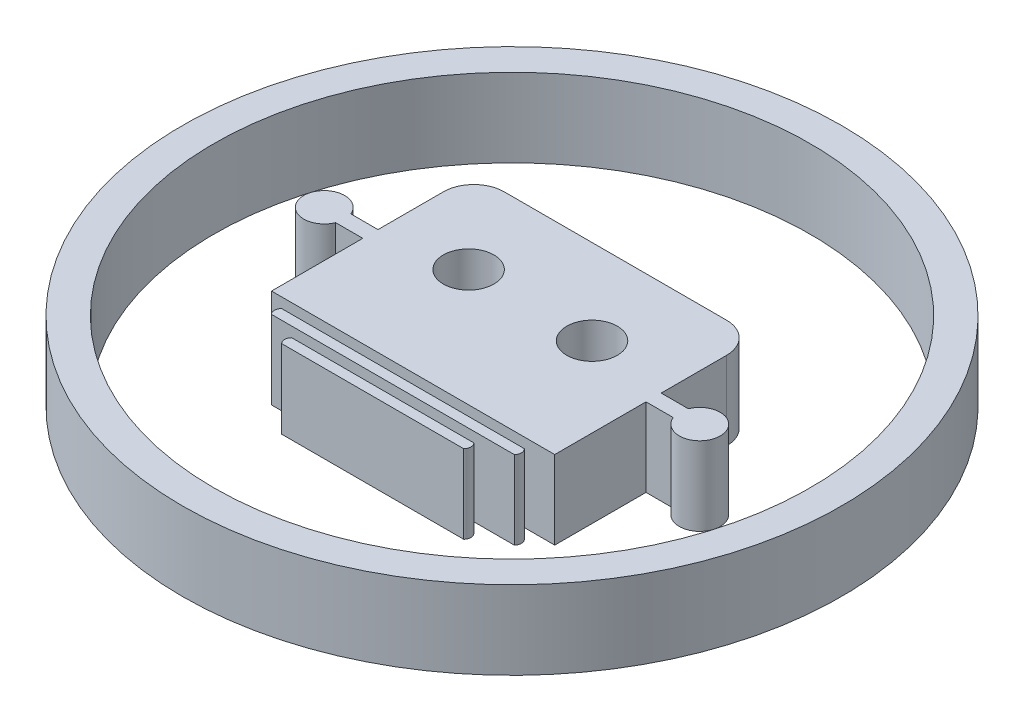
ISO-10303-21;
HEADER;
FILE_DESCRIPTION(('STEP AP214'),'2;1');
FILE_NAME('part.step','',(''),(''),'','','');
FILE_SCHEMA(('AUTOMOTIVE_DESIGN { 1 0 10303 214 1 1 1 1 }'));
ENDSEC;
DATA;
#1=APPLICATION_CONTEXT('core data for automotive mechanical design processes');
#2=APPLICATION_PROTOCOL_DEFINITION('international standard','automotive_design',2000,#1);
#3=PRODUCT_CONTEXT('',#1,'mechanical');
#4=PRODUCT('Part','Part','',(#3));
#5=PRODUCT_RELATED_PRODUCT_CATEGORY('part','',(#4));
#6=PRODUCT_DEFINITION_FORMATION('','',#4);
#7=PRODUCT_DEFINITION_CONTEXT('part definition',#1,'design');
#8=PRODUCT_DEFINITION('design','',#6,#7);
#9=PRODUCT_DEFINITION_SHAPE('','',#8);
#10=(LENGTH_UNIT() NAMED_UNIT(*) SI_UNIT(.MILLI.,.METRE.));
#11=(NAMED_UNIT(*) PLANE_ANGLE_UNIT() SI_UNIT($,.RADIAN.));
#12=(NAMED_UNIT(*) SI_UNIT($,.STERADIAN.) SOLID_ANGLE_UNIT());
#13=UNCERTAINTY_MEASURE_WITH_UNIT(LENGTH_MEASURE(1.E-05),#10,'distance_accuracy_value','');
#14=(GEOMETRIC_REPRESENTATION_CONTEXT(3) GLOBAL_UNCERTAINTY_ASSIGNED_CONTEXT((#13)) GLOBAL_UNIT_ASSIGNED_CONTEXT((#10,
#11,#12)) REPRESENTATION_CONTEXT('',''));
#15=CARTESIAN_POINT('',(0.,0.,0.));
#16=DIRECTION('',(0.,0.,1.));
#17=DIRECTION('',(1.,0.,0.));
#18=AXIS2_PLACEMENT_3D('',#15,#16,#17);
#19=CARTESIAN_POINT('',(-28.2447477639109,5.,-79.5975118594782));
#20=DIRECTION('',(0.,-1.,0.));
#21=DIRECTION('',(0.,0.,-1.));
#22=AXIS2_PLACEMENT_3D('',#19,#20,#21);
#23=CYLINDRICAL_SURFACE('',#22,0.45573183286291);
#24=CARTESIAN_POINT('',(-28.2447477639109,0.,-79.5975118594782));
#25=DIRECTION('',(0.,1.,0.));
#26=DIRECTION('',(0.,0.,1.));
#27=AXIS2_PLACEMENT_3D('',#24,#25,#26);
#28=CIRCLE('',#27,0.45573183286291);
#29=CARTESIAN_POINT('',(-27.9224966944909,0.,-79.9197629288981));
#30=VERTEX_POINT('',#29);
#31=CARTESIAN_POINT('',(-27.9224966944909,0.,-79.2752607900582));
#32=VERTEX_POINT('',#31);
#33=EDGE_CURVE('E195',#30,#32,#28,.F.);
#34=ORIENTED_EDGE('',*,*,#33,.F.);
#35=DIRECTION('',(0.,-1.,0.));
#36=VECTOR('',#35,1.);
#37=CARTESIAN_POINT('',(-27.9224966944909,5.,-79.9197629288981));
#38=LINE('',#37,#36);
#39=CARTESIAN_POINT('',(-27.9224966944909,5.,-79.9197629288981));
#40=VERTEX_POINT('',#39);
#41=EDGE_CURVE('E14',#40,#30,#38,.T.);
#42=ORIENTED_EDGE('',*,*,#41,.F.);
#43=CARTESIAN_POINT('',(-28.2447477639109,5.,-79.5975118594782));
#44=DIRECTION('',(0.,1.,0.));
#45=DIRECTION('',(0.,0.,1.));
#46=AXIS2_PLACEMENT_3D('',#43,#44,#45);
#47=CIRCLE('',#46,0.45573183286291);
#48=CARTESIAN_POINT('',(-27.9224966944909,5.,-79.2752607900582));
#49=VERTEX_POINT('',#48);
#50=EDGE_CURVE('E183',#40,#49,#47,.F.);
#51=ORIENTED_EDGE('',*,*,#50,.T.);
#52=DIRECTION('',(0.,-1.,0.));
#53=VECTOR('',#52,1.);
#54=CARTESIAN_POINT('',(-27.9224966944909,5.,-79.2752607900582));
#55=LINE('',#54,#53);
#56=EDGE_CURVE('E163',#49,#32,#55,.T.);
#57=ORIENTED_EDGE('',*,*,#56,.T.);
#58=EDGE_LOOP('',(#34,#42,#51,#57));
#59=FACE_BOUND('',#58,.T.);
#60=ADVANCED_FACE('F125',(#59),#23,.T.);
#61=CARTESIAN_POINT('',(0.,5.,-79.9197629288981));
#62=DIRECTION('',(0.,0.,-1.));
#63=DIRECTION('',(-1.,0.,0.));
#64=AXIS2_PLACEMENT_3D('',#61,#62,#63);
#65=PLANE('',#64);
#66=DIRECTION('',(1.,0.,0.));
#67=VECTOR('',#66,1.);
#68=CARTESIAN_POINT('',(0.,0.,-79.9197629288981));
#69=LINE('',#68,#67);
#70=CARTESIAN_POINT('',(-43.3905480266472,0.,-79.9197629288981));
#71=VERTEX_POINT('',#70);
#72=EDGE_CURVE('E176',#71,#30,#69,.T.);
#73=ORIENTED_EDGE('',*,*,#72,.F.);
#74=DIRECTION('',(0.,-1.,0.));
#75=VECTOR('',#74,1.);
#76=CARTESIAN_POINT('',(-43.3905480266472,5.,-79.9197629288981));
#77=LINE('',#76,#75);
#78=CARTESIAN_POINT('',(-43.3905480266472,5.,-79.9197629288981));
#79=VERTEX_POINT('',#78);
#80=EDGE_CURVE('E133',#79,#71,#77,.T.);
#81=ORIENTED_EDGE('',*,*,#80,.F.);
#82=DIRECTION('',(1.,0.,0.));
#83=VECTOR('',#82,1.);
#84=CARTESIAN_POINT('',(0.,5.,-79.9197629288981));
#85=LINE('',#84,#83);
#86=EDGE_CURVE('E174',#79,#40,#85,.T.);
#87=ORIENTED_EDGE('',*,*,#86,.T.);
#88=ORIENTED_EDGE('',*,*,#41,.T.);
#89=EDGE_LOOP('',(#73,#81,#87,#88));
#90=FACE_BOUND('',#89,.T.);
#91=ADVANCED_FACE('F172',(#90),#65,.T.);
#92=CARTESIAN_POINT('',(-43.0682969572273,5.,-79.5975118594782));
#93=DIRECTION('',(0.,-1.,0.));
#94=DIRECTION('',(0.,0.,-1.));
#95=AXIS2_PLACEMENT_3D('',#92,#93,#94);
#96=CYLINDRICAL_SURFACE('',#95,0.455731832862915);
#97=CARTESIAN_POINT('',(-43.0682969572273,0.,-79.5975118594782));
#98=DIRECTION('',(0.,1.,0.));
#99=DIRECTION('',(0.,0.,1.));
#100=AXIS2_PLACEMENT_3D('',#97,#98,#99);
#101=CIRCLE('',#100,0.455731832862915);
#102=CARTESIAN_POINT('',(-43.3905480266472,0.,-79.2752607900582));
#103=VERTEX_POINT('',#102);
#104=EDGE_CURVE('E156',#71,#103,#101,.T.);
#105=ORIENTED_EDGE('',*,*,#104,.T.);
#106=DIRECTION('',(0.,-1.,0.));
#107=VECTOR('',#106,1.);
#108=CARTESIAN_POINT('',(-43.3905480266472,5.,-79.2752607900582));
#109=LINE('',#108,#107);
#110=CARTESIAN_POINT('',(-43.3905480266472,5.,-79.2752607900582));
#111=VERTEX_POINT('',#110);
#112=EDGE_CURVE('E177',#111,#103,#109,.T.);
#113=ORIENTED_EDGE('',*,*,#112,.F.);
#114=CARTESIAN_POINT('',(-43.0682969572273,5.,-79.5975118594782));
#115=DIRECTION('',(0.,1.,0.));
#116=DIRECTION('',(0.,0.,1.));
#117=AXIS2_PLACEMENT_3D('',#114,#115,#116);
#118=CIRCLE('',#117,0.455731832862915);
#119=EDGE_CURVE('E178',#79,#111,#118,.T.);
#120=ORIENTED_EDGE('',*,*,#119,.F.);
#121=ORIENTED_EDGE('',*,*,#80,.T.);
#122=EDGE_LOOP('',(#105,#113,#120,#121));
#123=FACE_BOUND('',#122,.T.);
#124=ADVANCED_FACE('F179',(#123),#96,.T.);
#125=CARTESIAN_POINT('',(0.,5.,-79.2752607900582));
#126=DIRECTION('',(0.,0.,-1.));
#127=DIRECTION('',(-1.,0.,0.));
#128=AXIS2_PLACEMENT_3D('',#125,#126,#127);
#129=PLANE('',#128);
#130=DIRECTION('',(1.,0.,0.));
#131=VECTOR('',#130,1.);
#132=CARTESIAN_POINT('',(0.,0.,-79.2752607900582));
#133=LINE('',#132,#131);
#134=EDGE_CURVE('E187',#103,#32,#133,.T.);
#135=ORIENTED_EDGE('',*,*,#134,.T.);
#136=ORIENTED_EDGE('',*,*,#56,.F.);
#137=DIRECTION('',(1.,0.,0.));
#138=VECTOR('',#137,1.);
#139=CARTESIAN_POINT('',(0.,5.,-79.2752607900582));
#140=LINE('',#139,#138);
#141=EDGE_CURVE('E141',#111,#49,#140,.T.);
#142=ORIENTED_EDGE('',*,*,#141,.F.);
#143=ORIENTED_EDGE('',*,*,#112,.T.);
#144=EDGE_LOOP('',(#135,#136,#142,#143));
#145=FACE_BOUND('',#144,.T.);
#146=ADVANCED_FACE('F204',(#145),#129,.F.);
#147=CARTESIAN_POINT('',(0.,5.,0.));
#148=DIRECTION('',(0.,1.,0.));
#149=DIRECTION('',(0.,0.,1.));
#150=AXIS2_PLACEMENT_3D('',#147,#148,#149);
#151=PLANE('',#150);
#152=ORIENTED_EDGE('',*,*,#50,.F.);
#153=ORIENTED_EDGE('',*,*,#86,.F.);
#154=ORIENTED_EDGE('',*,*,#119,.T.);
#155=ORIENTED_EDGE('',*,*,#141,.T.);
#156=EDGE_LOOP('',(#152,#153,#154,#155));
#157=FACE_BOUND('',#156,.T.);
#158=ADVANCED_FACE('F182',(#157),#151,.T.);
#159=CARTESIAN_POINT('',(0.,0.,0.));
#160=DIRECTION('',(0.,1.,0.));
#161=DIRECTION('',(0.,0.,1.));
#162=AXIS2_PLACEMENT_3D('',#159,#160,#161);
#163=PLANE('',#162);
#164=ORIENTED_EDGE('',*,*,#33,.T.);
#165=ORIENTED_EDGE('',*,*,#134,.F.);
#166=ORIENTED_EDGE('',*,*,#104,.F.);
#167=ORIENTED_EDGE('',*,*,#72,.T.);
#168=EDGE_LOOP('',(#164,#165,#166,#167));
#169=FACE_BOUND('',#168,.T.);
#170=ADVANCED_FACE('F206',(#169),#163,.F.);
#171=CLOSED_SHELL('',(#60,#91,#124,#146,#158,#170));
#172=MANIFOLD_SOLID_BREP('B2',#171);
#173=CARTESIAN_POINT('',(-30.1782541804304,5.,-78.3085075817985));
#174=DIRECTION('',(0.,-1.,0.));
#175=DIRECTION('',(0.,0.,-1.));
#176=AXIS2_PLACEMENT_3D('',#173,#174,#175);
#177=CYLINDRICAL_SURFACE('',#176,0.45573183286289);
#178=CARTESIAN_POINT('',(-30.1782541804304,0.,-78.3085075817985));
#179=DIRECTION('',(0.,1.,0.));
#180=DIRECTION('',(0.,0.,1.));
#181=AXIS2_PLACEMENT_3D('',#178,#179,#180);
#182=CIRCLE('',#181,0.45573183286289);
#183=CARTESIAN_POINT('',(-29.8560031110105,0.,-78.6307586512184));
#184=VERTEX_POINT('',#183);
#185=CARTESIAN_POINT('',(-29.8560031110105,0.,-77.9862565123785));
#186=VERTEX_POINT('',#185);
#187=EDGE_CURVE('E339',#184,#186,#182,.F.);
#188=ORIENTED_EDGE('',*,*,#187,.F.);
#189=DIRECTION('',(0.,-1.,0.));
#190=VECTOR('',#189,1.);
#191=CARTESIAN_POINT('',(-29.8560031110105,5.,-78.6307586512184));
#192=LINE('',#191,#190);
#193=CARTESIAN_POINT('',(-29.8560031110105,5.,-78.6307586512184));
#194=VERTEX_POINT('',#193);
#195=EDGE_CURVE('E123',#194,#184,#192,.T.);
#196=ORIENTED_EDGE('',*,*,#195,.F.);
#197=CARTESIAN_POINT('',(-30.1782541804304,5.,-78.3085075817985));
#198=DIRECTION('',(0.,1.,0.));
#199=DIRECTION('',(0.,0.,1.));
#200=AXIS2_PLACEMENT_3D('',#197,#198,#199);
#201=CIRCLE('',#200,0.45573183286289);
#202=CARTESIAN_POINT('',(-29.8560031110105,5.,-77.9862565123785));
#203=VERTEX_POINT('',#202);
#204=EDGE_CURVE('E327',#194,#203,#201,.F.);
#205=ORIENTED_EDGE('',*,*,#204,.T.);
#206=DIRECTION('',(0.,-1.,0.));
#207=VECTOR('',#206,1.);
#208=CARTESIAN_POINT('',(-29.8560031110105,5.,-77.9862565123785));
#209=LINE('',#208,#207);
#210=EDGE_CURVE('E307',#203,#186,#209,.T.);
#211=ORIENTED_EDGE('',*,*,#210,.T.);
#212=EDGE_LOOP('',(#188,#196,#205,#211));
#213=FACE_BOUND('',#212,.T.);
#214=ADVANCED_FACE('F269',(#213),#177,.T.);
#215=CARTESIAN_POINT('',(0.,5.,-78.6307586512184));
#216=DIRECTION('',(0.,0.,-1.));
#217=DIRECTION('',(-1.,0.,0.));
#218=AXIS2_PLACEMENT_3D('',#215,#216,#217);
#219=PLANE('',#218);
#220=DIRECTION('',(1.,0.,0.));
#221=VECTOR('',#220,1.);
#222=CARTESIAN_POINT('',(0.,0.,-78.6307586512184));
#223=LINE('',#222,#221);
#224=CARTESIAN_POINT('',(-41.4570416101277,0.,-78.6307586512184));
#225=VERTEX_POINT('',#224);
#226=EDGE_CURVE('E320',#225,#184,#223,.T.);
#227=ORIENTED_EDGE('',*,*,#226,.F.);
#228=DIRECTION('',(0.,-1.,0.));
#229=VECTOR('',#228,1.);
#230=CARTESIAN_POINT('',(-41.4570416101277,5.,-78.6307586512184));
#231=LINE('',#230,#229);
#232=CARTESIAN_POINT('',(-41.4570416101277,5.,-78.6307586512184));
#233=VERTEX_POINT('',#232);
#234=EDGE_CURVE('E277',#233,#225,#231,.T.);
#235=ORIENTED_EDGE('',*,*,#234,.F.);
#236=DIRECTION('',(1.,0.,0.));
#237=VECTOR('',#236,1.);
#238=CARTESIAN_POINT('',(0.,5.,-78.6307586512184));
#239=LINE('',#238,#237);
#240=EDGE_CURVE('E318',#233,#194,#239,.T.);
#241=ORIENTED_EDGE('',*,*,#240,.T.);
#242=ORIENTED_EDGE('',*,*,#195,.T.);
#243=EDGE_LOOP('',(#227,#235,#241,#242));
#244=FACE_BOUND('',#243,.T.);
#245=ADVANCED_FACE('F316',(#244),#219,.T.);
#246=CARTESIAN_POINT('',(-41.1347905407077,5.,-78.3085075817985));
#247=DIRECTION('',(0.,-1.,0.));
#248=DIRECTION('',(0.,0.,-1.));
#249=AXIS2_PLACEMENT_3D('',#246,#247,#248);
#250=CYLINDRICAL_SURFACE('',#249,0.45573183286289);
#251=CARTESIAN_POINT('',(-41.1347905407077,0.,-78.3085075817985));
#252=DIRECTION('',(0.,1.,0.));
#253=DIRECTION('',(0.,0.,1.));
#254=AXIS2_PLACEMENT_3D('',#251,#252,#253);
#255=CIRCLE('',#254,0.45573183286289);
#256=CARTESIAN_POINT('',(-41.4570416101277,0.,-77.9862565123785));
#257=VERTEX_POINT('',#256);
#258=EDGE_CURVE('E300',#225,#257,#255,.T.);
#259=ORIENTED_EDGE('',*,*,#258,.T.);
#260=DIRECTION('',(0.,-1.,0.));
#261=VECTOR('',#260,1.);
#262=CARTESIAN_POINT('',(-41.4570416101277,5.,-77.9862565123785));
#263=LINE('',#262,#261);
#264=CARTESIAN_POINT('',(-41.4570416101277,5.,-77.9862565123785));
#265=VERTEX_POINT('',#264);
#266=EDGE_CURVE('E321',#265,#257,#263,.T.);
#267=ORIENTED_EDGE('',*,*,#266,.F.);
#268=CARTESIAN_POINT('',(-41.1347905407077,5.,-78.3085075817985));
#269=DIRECTION('',(0.,1.,0.));
#270=DIRECTION('',(0.,0.,1.));
#271=AXIS2_PLACEMENT_3D('',#268,#269,#270);
#272=CIRCLE('',#271,0.45573183286289);
#273=EDGE_CURVE('E322',#233,#265,#272,.T.);
#274=ORIENTED_EDGE('',*,*,#273,.F.);
#275=ORIENTED_EDGE('',*,*,#234,.T.);
#276=EDGE_LOOP('',(#259,#267,#274,#275));
#277=FACE_BOUND('',#276,.T.);
#278=ADVANCED_FACE('F323',(#277),#250,.T.);
#279=CARTESIAN_POINT('',(0.,5.,-77.9862565123785));
#280=DIRECTION('',(0.,0.,-1.));
#281=DIRECTION('',(-1.,0.,0.));
#282=AXIS2_PLACEMENT_3D('',#279,#280,#281);
#283=PLANE('',#282);
#284=DIRECTION('',(1.,0.,0.));
#285=VECTOR('',#284,1.);
#286=CARTESIAN_POINT('',(0.,0.,-77.9862565123785));
#287=LINE('',#286,#285);
#288=EDGE_CURVE('E331',#257,#186,#287,.T.);
#289=ORIENTED_EDGE('',*,*,#288,.T.);
#290=ORIENTED_EDGE('',*,*,#210,.F.);
#291=DIRECTION('',(1.,0.,0.));
#292=VECTOR('',#291,1.);
#293=CARTESIAN_POINT('',(0.,5.,-77.9862565123785));
#294=LINE('',#293,#292);
#295=EDGE_CURVE('E285',#265,#203,#294,.T.);
#296=ORIENTED_EDGE('',*,*,#295,.F.);
#297=ORIENTED_EDGE('',*,*,#266,.T.);
#298=EDGE_LOOP('',(#289,#290,#296,#297));
#299=FACE_BOUND('',#298,.T.);
#300=ADVANCED_FACE('F348',(#299),#283,.F.);
#301=CARTESIAN_POINT('',(0.,5.,0.));
#302=DIRECTION('',(0.,1.,0.));
#303=DIRECTION('',(0.,0.,1.));
#304=AXIS2_PLACEMENT_3D('',#301,#302,#303);
#305=PLANE('',#304);
#306=ORIENTED_EDGE('',*,*,#204,.F.);
#307=ORIENTED_EDGE('',*,*,#240,.F.);
#308=ORIENTED_EDGE('',*,*,#273,.T.);
#309=ORIENTED_EDGE('',*,*,#295,.T.);
#310=EDGE_LOOP('',(#306,#307,#308,#309));
#311=FACE_BOUND('',#310,.T.);
#312=ADVANCED_FACE('F326',(#311),#305,.T.);
#313=CARTESIAN_POINT('',(0.,0.,0.));
#314=DIRECTION('',(0.,1.,0.));
#315=DIRECTION('',(0.,0.,1.));
#316=AXIS2_PLACEMENT_3D('',#313,#314,#315);
#317=PLANE('',#316);
#318=ORIENTED_EDGE('',*,*,#187,.T.);
#319=ORIENTED_EDGE('',*,*,#288,.F.);
#320=ORIENTED_EDGE('',*,*,#258,.F.);
#321=ORIENTED_EDGE('',*,*,#226,.T.);
#322=EDGE_LOOP('',(#318,#319,#320,#321));
#323=FACE_BOUND('',#322,.T.);
#324=ADVANCED_FACE('F350',(#323),#317,.F.);
#325=CLOSED_SHELL('',(#214,#245,#278,#300,#312,#324));
#326=MANIFOLD_SOLID_BREP('B8',#325);
#327=CARTESIAN_POINT('',(-26.6334924168118,5.,-1.77157378714725E-13));
#328=DIRECTION('',(1.,0.,0.));
#329=DIRECTION('',(0.,0.,-1.));
#330=AXIS2_PLACEMENT_3D('',#327,#328,#329);
#331=PLANE('',#330);
#332=DIRECTION('',(0.,0.,1.));
#333=VECTOR('',#332,1.);
#334=CARTESIAN_POINT('',(-26.6334924168118,0.,-1.77157378714725E-13));
#335=LINE('',#334,#333);
#336=CARTESIAN_POINT('',(-26.6334924168112,0.,-91.5208014280153));
#337=VERTEX_POINT('',#336);
#338=CARTESIAN_POINT('',(-26.6334924168112,0.,-87.3480826959693));
#339=VERTEX_POINT('',#338);
#340=EDGE_CURVE('E653',#337,#339,#335,.T.);
#341=ORIENTED_EDGE('',*,*,#340,.F.);
#342=DIRECTION('',(0.,-1.,0.));
#343=VECTOR('',#342,1.);
#344=CARTESIAN_POINT('',(-26.6334924168112,5.,-91.5208014280153));
#345=LINE('',#344,#343);
#346=CARTESIAN_POINT('',(-26.6334924168112,5.,-91.5208014280153));
#347=VERTEX_POINT('',#346);
#348=EDGE_CURVE('E267',#347,#337,#345,.T.);
#349=ORIENTED_EDGE('',*,*,#348,.F.);
#350=DIRECTION('',(0.,0.,1.));
#351=VECTOR('',#350,1.);
#352=CARTESIAN_POINT('',(-26.6334924168118,5.,-1.77157378714725E-13));
#353=LINE('',#352,#351);
#354=CARTESIAN_POINT('',(-26.6334924168112,5.,-87.3480826959693));
#355=VERTEX_POINT('',#354);
#356=EDGE_CURVE('E598',#347,#355,#353,.T.);
#357=ORIENTED_EDGE('',*,*,#356,.T.);
#358=DIRECTION('',(0.,-1.,0.));
#359=VECTOR('',#358,1.);
#360=CARTESIAN_POINT('',(-26.6334924168112,5.,-87.3480826959693));
#361=LINE('',#360,#359);
#362=EDGE_CURVE('E427',#355,#339,#361,.T.);
#363=ORIENTED_EDGE('',*,*,#362,.T.);
#364=EDGE_LOOP('',(#341,#349,#357,#363));
#365=FACE_BOUND('',#364,.T.);
#366=ADVANCED_FACE('F410',(#365),#331,.T.);
#367=CARTESIAN_POINT('',(-28.5669988333308,5.,-91.5208014280153));
#368=DIRECTION('',(0.,-1.,0.));
#369=DIRECTION('',(0.,0.,-1.));
#370=AXIS2_PLACEMENT_3D('',#367,#368,#369);
#371=CYLINDRICAL_SURFACE('',#370,1.93350641651954);
#372=CARTESIAN_POINT('',(-28.5669988333308,0.,-91.5208014280153));
#373=DIRECTION('',(0.,1.,0.));
#374=DIRECTION('',(0.,0.,1.));
#375=AXIS2_PLACEMENT_3D('',#372,#373,#374);
#376=CIRCLE('',#375,1.93350641651954);
#377=CARTESIAN_POINT('',(-28.5669988333308,0.,-93.4543078445348));
#378=VERTEX_POINT('',#377);
#379=EDGE_CURVE('E651',#337,#378,#376,.T.);
#380=ORIENTED_EDGE('',*,*,#379,.T.);
#381=DIRECTION('',(0.,-1.,0.));
#382=VECTOR('',#381,1.);
#383=CARTESIAN_POINT('',(-28.5669988333308,5.,-93.4543078445348));
#384=LINE('',#383,#382);
#385=CARTESIAN_POINT('',(-28.5669988333308,5.,-93.4543078445348));
#386=VERTEX_POINT('',#385);
#387=EDGE_CURVE('E419',#386,#378,#384,.T.);
#388=ORIENTED_EDGE('',*,*,#387,.F.);
#389=CARTESIAN_POINT('',(-28.5669988333308,5.,-91.5208014280153));
#390=DIRECTION('',(0.,1.,0.));
#391=DIRECTION('',(0.,0.,1.));
#392=AXIS2_PLACEMENT_3D('',#389,#390,#391);
#393=CIRCLE('',#392,1.93350641651954);
#394=EDGE_CURVE('E595',#347,#386,#393,.T.);
#395=ORIENTED_EDGE('',*,*,#394,.F.);
#396=ORIENTED_EDGE('',*,*,#348,.T.);
#397=EDGE_LOOP('',(#380,#388,#395,#396));
#398=FACE_BOUND('',#397,.T.);
#399=ADVANCED_FACE('F652',(#398),#371,.T.);
#400=CARTESIAN_POINT('',(0.,5.,-93.4543078445348));
#401=DIRECTION('',(0.,0.,-1.));
#402=DIRECTION('',(-1.,0.,0.));
#403=AXIS2_PLACEMENT_3D('',#400,#401,#402);
#404=PLANE('',#403);
#405=DIRECTION('',(1.,0.,0.));
#406=VECTOR('',#405,1.);
#407=CARTESIAN_POINT('',(0.,0.,-93.4543078445348));
#408=LINE('',#407,#406);
#409=CARTESIAN_POINT('',(-42.7460458878074,0.,-93.4543078445348));
#410=VERTEX_POINT('',#409);
#411=EDGE_CURVE('E647',#410,#378,#408,.T.);
#412=ORIENTED_EDGE('',*,*,#411,.F.);
#413=DIRECTION('',(0.,-1.,0.));
#414=VECTOR('',#413,1.);
#415=CARTESIAN_POINT('',(-42.7460458878074,5.,-93.4543078445348));
#416=LINE('',#415,#414);
#417=CARTESIAN_POINT('',(-42.7460458878074,5.,-93.4543078445348));
#418=VERTEX_POINT('',#417);
#419=EDGE_CURVE('E639',#418,#410,#416,.T.);
#420=ORIENTED_EDGE('',*,*,#419,.F.);
#421=DIRECTION('',(1.,0.,0.));
#422=VECTOR('',#421,1.);
#423=CARTESIAN_POINT('',(0.,5.,-93.4543078445348));
#424=LINE('',#423,#422);
#425=EDGE_CURVE('E587',#418,#386,#424,.T.);
#426=ORIENTED_EDGE('',*,*,#425,.T.);
#427=ORIENTED_EDGE('',*,*,#387,.T.);
#428=EDGE_LOOP('',(#412,#420,#426,#427));
#429=FACE_BOUND('',#428,.T.);
#430=ADVANCED_FACE('F645',(#429),#404,.T.);
#431=CARTESIAN_POINT('',(-42.7460458878074,5.,-91.5208014280153));
#432=DIRECTION('',(0.,-1.,0.));
#433=DIRECTION('',(0.,0.,-1.));
#434=AXIS2_PLACEMENT_3D('',#431,#432,#433);
#435=CYLINDRICAL_SURFACE('',#434,1.93350641651953);
#436=CARTESIAN_POINT('',(-42.7460458878074,0.,-91.5208014280153));
#437=DIRECTION('',(0.,1.,0.));
#438=DIRECTION('',(0.,0.,1.));
#439=AXIS2_PLACEMENT_3D('',#436,#437,#438);
#440=CIRCLE('',#439,1.93350641651953);
#441=CARTESIAN_POINT('',(-44.6795523043269,0.,-91.5208014280153));
#442=VERTEX_POINT('',#441);
#443=EDGE_CURVE('E659',#410,#442,#440,.T.);
#444=ORIENTED_EDGE('',*,*,#443,.T.);
#445=DIRECTION('',(0.,-1.,0.));
#446=VECTOR('',#445,1.);
#447=CARTESIAN_POINT('',(-44.6795523043269,5.,-91.5208014280153));
#448=LINE('',#447,#446);
#449=CARTESIAN_POINT('',(-44.6795523043269,5.,-91.5208014280153));
#450=VERTEX_POINT('',#449);
#451=EDGE_CURVE('E637',#450,#442,#448,.T.);
#452=ORIENTED_EDGE('',*,*,#451,.F.);
#453=CARTESIAN_POINT('',(-42.7460458878074,5.,-91.5208014280153));
#454=DIRECTION('',(0.,1.,0.));
#455=DIRECTION('',(0.,0.,1.));
#456=AXIS2_PLACEMENT_3D('',#453,#454,#455);
#457=CIRCLE('',#456,1.93350641651953);
#458=EDGE_CURVE('E583',#418,#450,#457,.T.);
#459=ORIENTED_EDGE('',*,*,#458,.F.);
#460=ORIENTED_EDGE('',*,*,#419,.T.);
#461=EDGE_LOOP('',(#444,#452,#459,#460));
#462=FACE_BOUND('',#461,.T.);
#463=ADVANCED_FACE('F713',(#462),#435,.T.);
#464=CARTESIAN_POINT('',(-44.6795523043275,5.,-2.97193933281755E-13));
#465=DIRECTION('',(-1.,0.,0.));
#466=DIRECTION('',(0.,0.,1.));
#467=AXIS2_PLACEMENT_3D('',#464,#465,#466);
#468=PLANE('',#467);
#469=DIRECTION('',(0.,0.,-1.));
#470=VECTOR('',#469,1.);
#471=CARTESIAN_POINT('',(-44.6795523043275,0.,-2.97193933281755E-13));
#472=LINE('',#471,#470);
#473=CARTESIAN_POINT('',(-44.6795523043269,0.,-87.3480826959693));
#474=VERTEX_POINT('',#473);
#475=EDGE_CURVE('E661',#474,#442,#472,.T.);
#476=ORIENTED_EDGE('',*,*,#475,.F.);
#477=DIRECTION('',(0.,-1.,0.));
#478=VECTOR('',#477,1.);
#479=CARTESIAN_POINT('',(-44.6795523043269,5.,-87.3480826959693));
#480=LINE('',#479,#478);
#481=CARTESIAN_POINT('',(-44.6795523043269,5.,-87.3480826959693));
#482=VERTEX_POINT('',#481);
#483=EDGE_CURVE('E635',#482,#474,#480,.T.);
#484=ORIENTED_EDGE('',*,*,#483,.F.);
#485=DIRECTION('',(0.,0.,-1.));
#486=VECTOR('',#485,1.);
#487=CARTESIAN_POINT('',(-44.6795523043275,5.,-2.97193933281755E-13));
#488=LINE('',#487,#486);
#489=EDGE_CURVE('E578',#482,#450,#488,.T.);
#490=ORIENTED_EDGE('',*,*,#489,.T.);
#491=ORIENTED_EDGE('',*,*,#451,.T.);
#492=EDGE_LOOP('',(#476,#484,#490,#491));
#493=FACE_BOUND('',#492,.T.);
#494=ADVANCED_FACE('F708',(#493),#468,.T.);
#495=CARTESIAN_POINT('',(0.,5.,-87.3480826959693));
#496=DIRECTION('',(0.,0.,-1.));
#497=DIRECTION('',(-1.,0.,0.));
#498=AXIS2_PLACEMENT_3D('',#495,#496,#497);
#499=PLANE('',#498);
#500=DIRECTION('',(1.,0.,0.));
#501=VECTOR('',#500,1.);
#502=CARTESIAN_POINT('',(0.,0.,-87.3480826959693));
#503=LINE('',#502,#501);
#504=CARTESIAN_POINT('',(-46.4121857606302,0.,-87.3480826959693));
#505=VERTEX_POINT('',#504);
#506=EDGE_CURVE('E666',#505,#474,#503,.T.);
#507=ORIENTED_EDGE('',*,*,#506,.F.);
#508=DIRECTION('',(0.,-1.,0.));
#509=VECTOR('',#508,1.);
#510=CARTESIAN_POINT('',(-46.4121857606302,5.,-87.3480826959693));
#511=LINE('',#510,#509);
#512=CARTESIAN_POINT('',(-46.4121857606302,5.,-87.3480826959693));
#513=VERTEX_POINT('',#512);
#514=EDGE_CURVE('E633',#513,#505,#511,.T.);
#515=ORIENTED_EDGE('',*,*,#514,.F.);
#516=DIRECTION('',(1.,0.,0.));
#517=VECTOR('',#516,1.);
#518=CARTESIAN_POINT('',(0.,5.,-87.3480826959693));
#519=LINE('',#518,#517);
#520=EDGE_CURVE('E574',#513,#482,#519,.T.);
#521=ORIENTED_EDGE('',*,*,#520,.T.);
#522=ORIENTED_EDGE('',*,*,#483,.T.);
#523=EDGE_LOOP('',(#507,#515,#521,#522));
#524=FACE_BOUND('',#523,.T.);
#525=ADVANCED_FACE('F705',(#524),#499,.T.);
#526=CARTESIAN_POINT('',(-47.6224304451511,5.,-86.8647060918394));
#527=DIRECTION('',(0.,-1.,0.));
#528=DIRECTION('',(0.,0.,-1.));
#529=AXIS2_PLACEMENT_3D('',#526,#527,#528);
#530=CYLINDRICAL_SURFACE('',#529,1.30320571585279);
#531=CARTESIAN_POINT('',(-47.6224304451511,0.,-86.8647060918394));
#532=DIRECTION('',(0.,1.,0.));
#533=DIRECTION('',(0.,0.,1.));
#534=AXIS2_PLACEMENT_3D('',#531,#532,#533);
#535=CIRCLE('',#534,1.30320571585279);
#536=CARTESIAN_POINT('',(-46.4121857606302,0.,-86.3813294877095));
#537=VERTEX_POINT('',#536);
#538=EDGE_CURVE('E669',#505,#537,#535,.T.);
#539=ORIENTED_EDGE('',*,*,#538,.T.);
#540=DIRECTION('',(0.,-1.,0.));
#541=VECTOR('',#540,1.);
#542=CARTESIAN_POINT('',(-46.4121857606302,5.,-86.3813294877095));
#543=LINE('',#542,#541);
#544=CARTESIAN_POINT('',(-46.4121857606302,5.,-86.3813294877095));
#545=VERTEX_POINT('',#544);
#546=EDGE_CURVE('E631',#545,#537,#543,.T.);
#547=ORIENTED_EDGE('',*,*,#546,.F.);
#548=CARTESIAN_POINT('',(-47.6224304451511,5.,-86.8647060918394));
#549=DIRECTION('',(0.,1.,0.));
#550=DIRECTION('',(0.,0.,1.));
#551=AXIS2_PLACEMENT_3D('',#548,#549,#550);
#552=CIRCLE('',#551,1.30320571585279);
#553=EDGE_CURVE('E566',#513,#545,#552,.T.);
#554=ORIENTED_EDGE('',*,*,#553,.F.);
#555=ORIENTED_EDGE('',*,*,#514,.T.);
#556=EDGE_LOOP('',(#539,#547,#554,#555));
#557=FACE_BOUND('',#556,.T.);
#558=ADVANCED_FACE('F702',(#557),#530,.T.);
#559=CARTESIAN_POINT('',(0.,5.,-86.3813294877095));
#560=DIRECTION('',(0.,0.,1.));
#561=DIRECTION('',(1.,0.,0.));
#562=AXIS2_PLACEMENT_3D('',#559,#560,#561);
#563=PLANE('',#562);
#564=DIRECTION('',(-1.,0.,0.));
#565=VECTOR('',#564,1.);
#566=CARTESIAN_POINT('',(0.,0.,-86.3813294877095));
#567=LINE('',#566,#565);
#568=CARTESIAN_POINT('',(-44.6795523043269,0.,-86.3813294877095));
#569=VERTEX_POINT('',#568);
#570=EDGE_CURVE('E672',#569,#537,#567,.T.);
#571=ORIENTED_EDGE('',*,*,#570,.F.);
#572=DIRECTION('',(0.,-1.,0.));
#573=VECTOR('',#572,1.);
#574=CARTESIAN_POINT('',(-44.6795523043269,5.,-86.3813294877095));
#575=LINE('',#574,#573);
#576=CARTESIAN_POINT('',(-44.6795523043269,5.,-86.3813294877095));
#577=VERTEX_POINT('',#576);
#578=EDGE_CURVE('E629',#577,#569,#575,.T.);
#579=ORIENTED_EDGE('',*,*,#578,.F.);
#580=DIRECTION('',(-1.,0.,0.));
#581=VECTOR('',#580,1.);
#582=CARTESIAN_POINT('',(0.,5.,-86.3813294877095));
#583=LINE('',#582,#581);
#584=EDGE_CURVE('E561',#577,#545,#583,.T.);
#585=ORIENTED_EDGE('',*,*,#584,.T.);
#586=ORIENTED_EDGE('',*,*,#546,.T.);
#587=EDGE_LOOP('',(#571,#579,#585,#586));
#588=FACE_BOUND('',#587,.T.);
#589=ADVANCED_FACE('F697',(#588),#563,.T.);
#590=CARTESIAN_POINT('',(-44.6795523043265,5.,2.13184280407408E-13));
#591=DIRECTION('',(-1.,0.,0.));
#592=DIRECTION('',(0.,0.,1.));
#593=AXIS2_PLACEMENT_3D('',#590,#591,#592);
#594=PLANE('',#593);
#595=DIRECTION('',(0.,0.,-1.));
#596=VECTOR('',#595,1.);
#597=CARTESIAN_POINT('',(-44.6795523043265,0.,2.13184280407408E-13));
#598=LINE('',#597,#596);
#599=CARTESIAN_POINT('',(-44.6795523043269,0.,-80.5642650677379));
#600=VERTEX_POINT('',#599);
#601=EDGE_CURVE('E675',#600,#569,#598,.T.);
#602=ORIENTED_EDGE('',*,*,#601,.F.);
#603=DIRECTION('',(0.,-1.,0.));
#604=VECTOR('',#603,1.);
#605=CARTESIAN_POINT('',(-44.6795523043269,5.,-80.5642650677379));
#606=LINE('',#605,#604);
#607=CARTESIAN_POINT('',(-44.6795523043269,5.,-80.5642650677379));
#608=VERTEX_POINT('',#607);
#609=EDGE_CURVE('E627',#608,#600,#606,.T.);
#610=ORIENTED_EDGE('',*,*,#609,.F.);
#611=DIRECTION('',(0.,0.,-1.));
#612=VECTOR('',#611,1.);
#613=CARTESIAN_POINT('',(-44.6795523043265,5.,2.13184280407408E-13));
#614=LINE('',#613,#612);
#615=EDGE_CURVE('E556',#608,#577,#614,.T.);
#616=ORIENTED_EDGE('',*,*,#615,.T.);
#617=ORIENTED_EDGE('',*,*,#578,.T.);
#618=EDGE_LOOP('',(#602,#610,#616,#617));
#619=FACE_BOUND('',#618,.T.);
#620=ADVANCED_FACE('F692',(#619),#594,.T.);
#621=CARTESIAN_POINT('',(0.,5.,-80.5642650677379));
#622=DIRECTION('',(0.,0.,1.));
#623=DIRECTION('',(1.,0.,0.));
#624=AXIS2_PLACEMENT_3D('',#621,#622,#623);
#625=PLANE('',#624);
#626=DIRECTION('',(-1.,0.,0.));
#627=VECTOR('',#626,1.);
#628=CARTESIAN_POINT('',(0.,0.,-80.5642650677379));
#629=LINE('',#628,#627);
#630=CARTESIAN_POINT('',(-26.6334924168112,0.,-80.5642650677379));
#631=VERTEX_POINT('',#630);
#632=EDGE_CURVE('E678',#631,#600,#629,.T.);
#633=ORIENTED_EDGE('',*,*,#632,.F.);
#634=DIRECTION('',(0.,-1.,0.));
#635=VECTOR('',#634,1.);
#636=CARTESIAN_POINT('',(-26.6334924168112,5.,-80.5642650677379));
#637=LINE('',#636,#635);
#638=CARTESIAN_POINT('',(-26.6334924168112,5.,-80.5642650677379));
#639=VERTEX_POINT('',#638);
#640=EDGE_CURVE('E625',#639,#631,#637,.T.);
#641=ORIENTED_EDGE('',*,*,#640,.F.);
#642=DIRECTION('',(-1.,0.,0.));
#643=VECTOR('',#642,1.);
#644=CARTESIAN_POINT('',(0.,5.,-80.5642650677379));
#645=LINE('',#644,#643);
#646=EDGE_CURVE('E541',#639,#608,#645,.T.);
#647=ORIENTED_EDGE('',*,*,#646,.T.);
#648=ORIENTED_EDGE('',*,*,#609,.T.);
#649=EDGE_LOOP('',(#633,#641,#647,#648));
#650=FACE_BOUND('',#649,.T.);
#651=ADVANCED_FACE('F688',(#650),#625,.T.);
#652=CARTESIAN_POINT('',(-26.6334924168112,5.,0.));
#653=DIRECTION('',(1.,0.,0.));
#654=DIRECTION('',(0.,0.,-1.));
#655=AXIS2_PLACEMENT_3D('',#652,#653,#654);
#656=PLANE('',#655);
#657=DIRECTION('',(0.,0.,1.));
#658=VECTOR('',#657,1.);
#659=CARTESIAN_POINT('',(-26.6334924168112,0.,0.));
#660=LINE('',#659,#658);
#661=CARTESIAN_POINT('',(-26.6334924168112,0.,-86.3813294877095));
#662=VERTEX_POINT('',#661);
#663=EDGE_CURVE('E681',#662,#631,#660,.T.);
#664=ORIENTED_EDGE('',*,*,#663,.F.);
#665=DIRECTION('',(0.,-1.,0.));
#666=VECTOR('',#665,1.);
#667=CARTESIAN_POINT('',(-26.6334924168112,5.,-86.3813294877095));
#668=LINE('',#667,#666);
#669=CARTESIAN_POINT('',(-26.6334924168112,5.,-86.3813294877095));
#670=VERTEX_POINT('',#669);
#671=EDGE_CURVE('E523',#670,#662,#668,.T.);
#672=ORIENTED_EDGE('',*,*,#671,.F.);
#673=DIRECTION('',(0.,0.,1.));
#674=VECTOR('',#673,1.);
#675=CARTESIAN_POINT('',(-26.6334924168112,5.,0.));
#676=LINE('',#675,#674);
#677=EDGE_CURVE('E537',#670,#639,#676,.T.);
#678=ORIENTED_EDGE('',*,*,#677,.T.);
#679=ORIENTED_EDGE('',*,*,#640,.T.);
#680=EDGE_LOOP('',(#664,#672,#678,#679));
#681=FACE_BOUND('',#680,.T.);
#682=ADVANCED_FACE('F686',(#681),#656,.T.);
#683=CARTESIAN_POINT('',(0.,5.,-86.3813294877095));
#684=DIRECTION('',(0.,0.,1.));
#685=DIRECTION('',(1.,0.,0.));
#686=AXIS2_PLACEMENT_3D('',#683,#684,#685);
#687=PLANE('',#686);
#688=DIRECTION('',(-1.,0.,0.));
#689=VECTOR('',#688,1.);
#690=CARTESIAN_POINT('',(0.,0.,-86.3813294877095));
#691=LINE('',#690,#689);
#692=CARTESIAN_POINT('',(-24.9008589605079,0.,-86.3813294877095));
#693=VERTEX_POINT('',#692);
#694=EDGE_CURVE('E520',#693,#662,#691,.T.);
#695=ORIENTED_EDGE('',*,*,#694,.F.);
#696=DIRECTION('',(0.,-1.,0.));
#697=VECTOR('',#696,1.);
#698=CARTESIAN_POINT('',(-24.9008589605079,5.,-86.3813294877095));
#699=LINE('',#698,#697);
#700=CARTESIAN_POINT('',(-24.9008589605079,5.,-86.3813294877095));
#701=VERTEX_POINT('',#700);
#702=EDGE_CURVE('E514',#701,#693,#699,.T.);
#703=ORIENTED_EDGE('',*,*,#702,.F.);
#704=DIRECTION('',(-1.,0.,0.));
#705=VECTOR('',#704,1.);
#706=CARTESIAN_POINT('',(0.,5.,-86.3813294877095));
#707=LINE('',#706,#705);
#708=EDGE_CURVE('E518',#701,#670,#707,.T.);
#709=ORIENTED_EDGE('',*,*,#708,.T.);
#710=ORIENTED_EDGE('',*,*,#671,.T.);
#711=EDGE_LOOP('',(#695,#703,#709,#710));
#712=FACE_BOUND('',#711,.T.);
#713=ADVANCED_FACE('F516',(#712),#687,.T.);
#714=CARTESIAN_POINT('',(-23.690614275987,5.,-86.8647060918394));
#715=DIRECTION('',(0.,-1.,0.));
#716=DIRECTION('',(0.,0.,-1.));
#717=AXIS2_PLACEMENT_3D('',#714,#715,#716);
#718=CYLINDRICAL_SURFACE('',#717,1.30320571585279);
#719=CARTESIAN_POINT('',(-23.690614275987,0.,-86.8647060918394));
#720=DIRECTION('',(0.,1.,0.));
#721=DIRECTION('',(0.,0.,1.));
#722=AXIS2_PLACEMENT_3D('',#719,#720,#721);
#723=CIRCLE('',#722,1.30320571585279);
#724=CARTESIAN_POINT('',(-24.9008589605079,0.,-87.3480826959693));
#725=VERTEX_POINT('',#724);
#726=EDGE_CURVE('E616',#693,#725,#723,.T.);
#727=ORIENTED_EDGE('',*,*,#726,.T.);
#728=DIRECTION('',(0.,-1.,0.));
#729=VECTOR('',#728,1.);
#730=CARTESIAN_POINT('',(-24.9008589605079,5.,-87.3480826959693));
#731=LINE('',#730,#729);
#732=CARTESIAN_POINT('',(-24.9008589605079,5.,-87.3480826959693));
#733=VERTEX_POINT('',#732);
#734=EDGE_CURVE('E471',#733,#725,#731,.T.);
#735=ORIENTED_EDGE('',*,*,#734,.F.);
#736=CARTESIAN_POINT('',(-23.690614275987,5.,-86.8647060918394));
#737=DIRECTION('',(0.,1.,0.));
#738=DIRECTION('',(0.,0.,1.));
#739=AXIS2_PLACEMENT_3D('',#736,#737,#738);
#740=CIRCLE('',#739,1.30320571585279);
#741=EDGE_CURVE('E525',#701,#733,#740,.T.);
#742=ORIENTED_EDGE('',*,*,#741,.F.);
#743=ORIENTED_EDGE('',*,*,#702,.T.);
#744=EDGE_LOOP('',(#727,#735,#742,#743));
#745=FACE_BOUND('',#744,.T.);
#746=ADVANCED_FACE('F526',(#745),#718,.T.);
#747=CARTESIAN_POINT('',(-31.7246524604709,5.,-88.0326600883949));
#748=DIRECTION('',(0.,-1.,0.));
#749=DIRECTION('',(0.,0.,-1.));
#750=AXIS2_PLACEMENT_3D('',#747,#748,#749);
#751=CYLINDRICAL_SURFACE('',#750,1.61125534709959);
#752=CARTESIAN_POINT('',(-31.7246524604709,5.,-88.0326600883949));
#753=DIRECTION('',(0.,1.,0.));
#754=DIRECTION('',(0.,0.,1.));
#755=AXIS2_PLACEMENT_3D('',#752,#753,#754);
#756=CIRCLE('',#755,1.61125534709959);
#757=CARTESIAN_POINT('',(-31.7246524604709,5.,-86.4214047412953));
#758=VERTEX_POINT('',#757);
#759=EDGE_CURVE('E602',#758,#758,#756,.T.);
#760=ORIENTED_EDGE('',*,*,#759,.T.);
#761=EDGE_LOOP('',(#760));
#762=FACE_BOUND('',#761,.T.);
#763=CARTESIAN_POINT('',(-31.7246524604709,0.,-88.0326600883949));
#764=DIRECTION('',(0.,1.,0.));
#765=DIRECTION('',(0.,0.,1.));
#766=AXIS2_PLACEMENT_3D('',#763,#764,#765);
#767=CIRCLE('',#766,1.61125534709959);
#768=CARTESIAN_POINT('',(-31.7246524604709,0.,-86.4214047412953));
#769=VERTEX_POINT('',#768);
#770=EDGE_CURVE('E736',#769,#769,#767,.T.);
#771=ORIENTED_EDGE('',*,*,#770,.F.);
#772=EDGE_LOOP('',(#771));
#773=FACE_BOUND('',#772,.T.);
#774=ADVANCED_FACE('F723',(#762,#773),#751,.F.);
#775=CARTESIAN_POINT('',(-39.5883922606672,5.,-88.0326600883949));
#776=DIRECTION('',(0.,-1.,0.));
#777=DIRECTION('',(0.,0.,-1.));
#778=AXIS2_PLACEMENT_3D('',#775,#776,#777);
#779=CYLINDRICAL_SURFACE('',#778,1.61125534709962);
#780=CARTESIAN_POINT('',(-39.5883922606672,5.,-88.0326600883949));
#781=DIRECTION('',(0.,1.,0.));
#782=DIRECTION('',(0.,0.,1.));
#783=AXIS2_PLACEMENT_3D('',#780,#781,#782);
#784=CIRCLE('',#783,1.61125534709962);
#785=CARTESIAN_POINT('',(-39.5883922606672,5.,-86.4214047412952));
#786=VERTEX_POINT('',#785);
#787=EDGE_CURVE('E607',#786,#786,#784,.T.);
#788=ORIENTED_EDGE('',*,*,#787,.T.);
#789=EDGE_LOOP('',(#788));
#790=FACE_BOUND('',#789,.T.);
#791=CARTESIAN_POINT('',(-39.5883922606672,0.,-88.0326600883949));
#792=DIRECTION('',(0.,1.,0.));
#793=DIRECTION('',(0.,0.,1.));
#794=AXIS2_PLACEMENT_3D('',#791,#792,#793);
#795=CIRCLE('',#794,1.61125534709962);
#796=CARTESIAN_POINT('',(-39.5883922606672,0.,-86.4214047412952));
#797=VERTEX_POINT('',#796);
#798=EDGE_CURVE('E738',#797,#797,#795,.T.);
#799=ORIENTED_EDGE('',*,*,#798,.F.);
#800=EDGE_LOOP('',(#799));
#801=FACE_BOUND('',#800,.T.);
#802=ADVANCED_FACE('F412',(#790,#801),#779,.F.);
#803=CARTESIAN_POINT('',(0.,5.,-87.3480826959693));
#804=DIRECTION('',(0.,0.,-1.));
#805=DIRECTION('',(-1.,0.,0.));
#806=AXIS2_PLACEMENT_3D('',#803,#804,#805);
#807=PLANE('',#806);
#808=DIRECTION('',(1.,0.,0.));
#809=VECTOR('',#808,1.);
#810=CARTESIAN_POINT('',(0.,0.,-87.3480826959693));
#811=LINE('',#810,#809);
#812=EDGE_CURVE('E612',#339,#725,#811,.T.);
#813=ORIENTED_EDGE('',*,*,#812,.F.);
#814=ORIENTED_EDGE('',*,*,#362,.F.);
#815=DIRECTION('',(1.,0.,0.));
#816=VECTOR('',#815,1.);
#817=CARTESIAN_POINT('',(0.,5.,-87.3480826959693));
#818=LINE('',#817,#816);
#819=EDGE_CURVE('E530',#355,#733,#818,.T.);
#820=ORIENTED_EDGE('',*,*,#819,.T.);
#821=ORIENTED_EDGE('',*,*,#734,.T.);
#822=EDGE_LOOP('',(#813,#814,#820,#821));
#823=FACE_BOUND('',#822,.T.);
#824=ADVANCED_FACE('F730',(#823),#807,.T.);
#825=CARTESIAN_POINT('',(0.,5.,0.));
#826=DIRECTION('',(0.,1.,0.));
#827=DIRECTION('',(0.,0.,1.));
#828=AXIS2_PLACEMENT_3D('',#825,#826,#827);
#829=PLANE('',#828);
#830=ORIENTED_EDGE('',*,*,#787,.F.);
#831=EDGE_LOOP('',(#830));
#832=FACE_BOUND('',#831,.T.);
#833=ORIENTED_EDGE('',*,*,#759,.F.);
#834=EDGE_LOOP('',(#833));
#835=FACE_BOUND('',#834,.T.);
#836=ORIENTED_EDGE('',*,*,#356,.F.);
#837=ORIENTED_EDGE('',*,*,#394,.T.);
#838=ORIENTED_EDGE('',*,*,#425,.F.);
#839=ORIENTED_EDGE('',*,*,#458,.T.);
#840=ORIENTED_EDGE('',*,*,#489,.F.);
#841=ORIENTED_EDGE('',*,*,#520,.F.);
#842=ORIENTED_EDGE('',*,*,#553,.T.);
#843=ORIENTED_EDGE('',*,*,#584,.F.);
#844=ORIENTED_EDGE('',*,*,#615,.F.);
#845=ORIENTED_EDGE('',*,*,#646,.F.);
#846=ORIENTED_EDGE('',*,*,#677,.F.);
#847=ORIENTED_EDGE('',*,*,#708,.F.);
#848=ORIENTED_EDGE('',*,*,#741,.T.);
#849=ORIENTED_EDGE('',*,*,#819,.F.);
#850=EDGE_LOOP('',(#836,#837,#838,#839,#840,#841,#842,#843,#844,#845,#846,#847,#848,#849));
#851=FACE_BOUND('',#850,.T.);
#852=ADVANCED_FACE('F534',(#832,#835,#851),#829,.T.);
#853=CARTESIAN_POINT('',(0.,0.,0.));
#854=DIRECTION('',(0.,1.,0.));
#855=DIRECTION('',(0.,0.,1.));
#856=AXIS2_PLACEMENT_3D('',#853,#854,#855);
#857=PLANE('',#856);
#858=ORIENTED_EDGE('',*,*,#798,.T.);
#859=EDGE_LOOP('',(#858));
#860=FACE_BOUND('',#859,.T.);
#861=ORIENTED_EDGE('',*,*,#770,.T.);
#862=EDGE_LOOP('',(#861));
#863=FACE_BOUND('',#862,.T.);
#864=ORIENTED_EDGE('',*,*,#340,.T.);
#865=ORIENTED_EDGE('',*,*,#812,.T.);
#866=ORIENTED_EDGE('',*,*,#726,.F.);
#867=ORIENTED_EDGE('',*,*,#694,.T.);
#868=ORIENTED_EDGE('',*,*,#663,.T.);
#869=ORIENTED_EDGE('',*,*,#632,.T.);
#870=ORIENTED_EDGE('',*,*,#601,.T.);
#871=ORIENTED_EDGE('',*,*,#570,.T.);
#872=ORIENTED_EDGE('',*,*,#538,.F.);
#873=ORIENTED_EDGE('',*,*,#506,.T.);
#874=ORIENTED_EDGE('',*,*,#475,.T.);
#875=ORIENTED_EDGE('',*,*,#443,.F.);
#876=ORIENTED_EDGE('',*,*,#411,.T.);
#877=ORIENTED_EDGE('',*,*,#379,.F.);
#878=EDGE_LOOP('',(#864,#865,#866,#867,#868,#869,#870,#871,#872,#873,#874,#875,#876,#877));
#879=FACE_BOUND('',#878,.T.);
#880=ADVANCED_FACE('F656',(#860,#863,#879),#857,.F.);
#881=CLOSED_SHELL('',(#366,#399,#430,#463,#494,#525,#558,#589,#620,#651,#682,#713,#746,#774,
#802,#824,#852,#880));
#882=MANIFOLD_SOLID_BREP('B117',#881);
#883=CARTESIAN_POINT('',(-35.6565223605691,5.,-86.8647060918394));
#884=DIRECTION('',(0.,-1.,0.));
#885=DIRECTION('',(0.,0.,-1.));
#886=AXIS2_PLACEMENT_3D('',#883,#884,#885);
#887=CYLINDRICAL_SURFACE('',#886,19.);
#888=CARTESIAN_POINT('',(-35.6565223605691,5.,-86.8647060918394));
#889=DIRECTION('',(0.,1.,0.));
#890=DIRECTION('',(0.,0.,1.));
#891=AXIS2_PLACEMENT_3D('',#888,#889,#890);
#892=CIRCLE('',#891,19.);
#893=CARTESIAN_POINT('',(-35.6565223605691,5.,-67.8647060918394));
#894=VERTEX_POINT('',#893);
#895=EDGE_CURVE('E891',#894,#894,#892,.T.);
#896=ORIENTED_EDGE('',*,*,#895,.T.);
#897=EDGE_LOOP('',(#896));
#898=FACE_BOUND('',#897,.T.);
#899=CARTESIAN_POINT('',(-35.6565223605691,0.,-86.8647060918394));
#900=DIRECTION('',(0.,1.,0.));
#901=DIRECTION('',(0.,0.,1.));
#902=AXIS2_PLACEMENT_3D('',#899,#900,#901);
#903=CIRCLE('',#902,19.);
#904=CARTESIAN_POINT('',(-35.6565223605691,0.,-67.8647060918394));
#905=VERTEX_POINT('',#904);
#906=EDGE_CURVE('E899',#905,#905,#903,.T.);
#907=ORIENTED_EDGE('',*,*,#906,.F.);
#908=EDGE_LOOP('',(#907));
#909=FACE_BOUND('',#908,.T.);
#910=ADVANCED_FACE('F883',(#898,#909),#887,.F.);
#911=CARTESIAN_POINT('',(-35.6565223605691,5.,-86.8647060918394));
#912=DIRECTION('',(0.,-1.,0.));
#913=DIRECTION('',(0.,0.,-1.));
#914=AXIS2_PLACEMENT_3D('',#911,#912,#913);
#915=CYLINDRICAL_SURFACE('',#914,21.);
#916=CARTESIAN_POINT('',(-35.6565223605691,5.,-86.8647060918394));
#917=DIRECTION('',(0.,1.,0.));
#918=DIRECTION('',(0.,0.,1.));
#919=AXIS2_PLACEMENT_3D('',#916,#917,#918);
#920=CIRCLE('',#919,21.);
#921=CARTESIAN_POINT('',(-35.6565223605691,5.,-65.8647060918394));
#922=VERTEX_POINT('',#921);
#923=EDGE_CURVE('E409',#922,#922,#920,.T.);
#924=ORIENTED_EDGE('',*,*,#923,.F.);
#925=EDGE_LOOP('',(#924));
#926=FACE_BOUND('',#925,.T.);
#927=CARTESIAN_POINT('',(-35.6565223605691,0.,-86.8647060918394));
#928=DIRECTION('',(0.,1.,0.));
#929=DIRECTION('',(0.,0.,1.));
#930=AXIS2_PLACEMENT_3D('',#927,#928,#929);
#931=CIRCLE('',#930,21.);
#932=CARTESIAN_POINT('',(-35.6565223605691,0.,-65.8647060918394));
#933=VERTEX_POINT('',#932);
#934=EDGE_CURVE('E886',#933,#933,#931,.T.);
#935=ORIENTED_EDGE('',*,*,#934,.T.);
#936=EDGE_LOOP('',(#935));
#937=FACE_BOUND('',#936,.T.);
#938=ADVANCED_FACE('F906',(#926,#937),#915,.T.);
#939=CARTESIAN_POINT('',(0.,5.,0.));
#940=DIRECTION('',(0.,1.,0.));
#941=DIRECTION('',(0.,0.,1.));
#942=AXIS2_PLACEMENT_3D('',#939,#940,#941);
#943=PLANE('',#942);
#944=ORIENTED_EDGE('',*,*,#895,.F.);
#945=EDGE_LOOP('',(#944));
#946=FACE_BOUND('',#945,.T.);
#947=ORIENTED_EDGE('',*,*,#923,.T.);
#948=EDGE_LOOP('',(#947));
#949=FACE_BOUND('',#948,.T.);
#950=ADVANCED_FACE('F910',(#946,#949),#943,.T.);
#951=CARTESIAN_POINT('',(0.,0.,0.));
#952=DIRECTION('',(0.,1.,0.));
#953=DIRECTION('',(0.,0.,1.));
#954=AXIS2_PLACEMENT_3D('',#951,#952,#953);
#955=PLANE('',#954);
#956=ORIENTED_EDGE('',*,*,#906,.T.);
#957=EDGE_LOOP('',(#956));
#958=FACE_BOUND('',#957,.T.);
#959=ORIENTED_EDGE('',*,*,#934,.F.);
#960=EDGE_LOOP('',(#959));
#961=FACE_BOUND('',#960,.T.);
#962=ADVANCED_FACE('F908',(#958,#961),#955,.F.);
#963=CLOSED_SHELL('',(#910,#938,#950,#962));
#964=MANIFOLD_SOLID_BREP('B261',#963);
#965=ADVANCED_BREP_SHAPE_REPRESENTATION('',(#18,#172,#326,#882,#964),#14);
#966=SHAPE_DEFINITION_REPRESENTATION(#9,#965);
ENDSEC;
END-ISO-10303-21;
